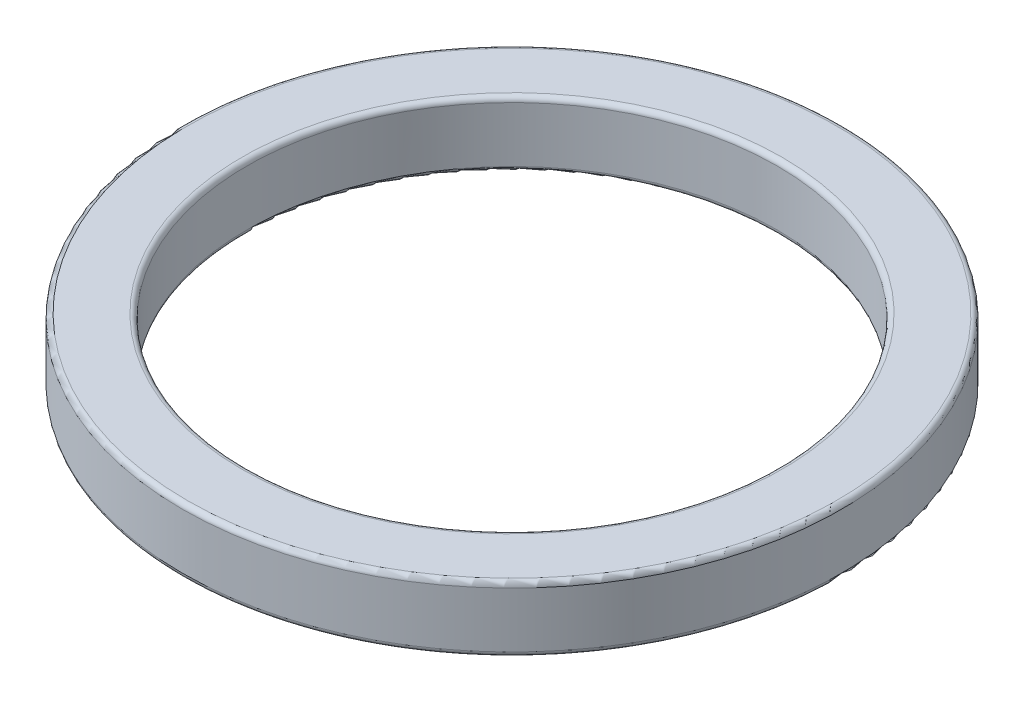
ISO-10303-21;
HEADER;
FILE_DESCRIPTION(('STEP AP214'),'2;1');
FILE_NAME('part.step','',(''),(''),'','','');
FILE_SCHEMA(('AUTOMOTIVE_DESIGN { 1 0 10303 214 1 1 1 1 }'));
ENDSEC;
DATA;
#1=APPLICATION_CONTEXT('core data for automotive mechanical design processes');
#2=APPLICATION_PROTOCOL_DEFINITION('international standard','automotive_design',2000,#1);
#3=PRODUCT_CONTEXT('',#1,'mechanical');
#4=PRODUCT('Part','Part','',(#3));
#5=PRODUCT_RELATED_PRODUCT_CATEGORY('part','',(#4));
#6=PRODUCT_DEFINITION_FORMATION('','',#4);
#7=PRODUCT_DEFINITION_CONTEXT('part definition',#1,'design');
#8=PRODUCT_DEFINITION('design','',#6,#7);
#9=PRODUCT_DEFINITION_SHAPE('','',#8);
#10=(LENGTH_UNIT() NAMED_UNIT(*) SI_UNIT(.MILLI.,.METRE.));
#11=(NAMED_UNIT(*) PLANE_ANGLE_UNIT() SI_UNIT($,.RADIAN.));
#12=(NAMED_UNIT(*) SI_UNIT($,.STERADIAN.) SOLID_ANGLE_UNIT());
#13=UNCERTAINTY_MEASURE_WITH_UNIT(LENGTH_MEASURE(1.E-05),#10,'distance_accuracy_value','');
#14=(GEOMETRIC_REPRESENTATION_CONTEXT(3) GLOBAL_UNCERTAINTY_ASSIGNED_CONTEXT((#13)) GLOBAL_UNIT_ASSIGNED_CONTEXT((#10,
#11,#12)) REPRESENTATION_CONTEXT('',''));
#15=CARTESIAN_POINT('',(0.,0.,0.));
#16=DIRECTION('',(0.,0.,1.));
#17=DIRECTION('',(1.,0.,0.));
#18=AXIS2_PLACEMENT_3D('',#15,#16,#17);
#19=CARTESIAN_POINT('',(0.,0.,0.));
#20=DIRECTION('',(0.,-1.,0.));
#21=DIRECTION('',(0.,0.,-1.));
#22=AXIS2_PLACEMENT_3D('',#19,#20,#21);
#23=CYLINDRICAL_SURFACE('',#22,5.27);
#24=CARTESIAN_POINT('',(0.,1.77172717271727,0.));
#25=DIRECTION('',(0.,-1.,0.));
#26=DIRECTION('',(0.,0.,-1.));
#27=AXIS2_PLACEMENT_3D('',#24,#25,#26);
#28=CIRCLE('',#27,5.27);
#29=CARTESIAN_POINT('',(0.,1.77172717271727,-5.27));
#30=VERTEX_POINT('',#29);
#31=EDGE_CURVE('E59',#30,#30,#28,.T.);
#32=ORIENTED_EDGE('',*,*,#31,.T.);
#33=EDGE_LOOP('',(#32));
#34=FACE_BOUND('',#33,.T.);
#35=CARTESIAN_POINT('',(0.,2.87172717271727,0.));
#36=DIRECTION('',(0.,1.,0.));
#37=DIRECTION('',(0.,0.,1.));
#38=AXIS2_PLACEMENT_3D('',#35,#36,#37);
#39=CIRCLE('',#38,5.27);
#40=CARTESIAN_POINT('',(0.,2.87172717271727,5.27));
#41=VERTEX_POINT('',#40);
#42=EDGE_CURVE('E62',#41,#41,#39,.T.);
#43=ORIENTED_EDGE('',*,*,#42,.T.);
#44=EDGE_LOOP('',(#43));
#45=FACE_BOUND('',#44,.T.);
#46=ADVANCED_FACE('F33',(#34,#45),#23,.F.);
#47=CARTESIAN_POINT('',(5.27,1.67172717271727,0.));
#48=DIRECTION('',(0.,-1.,0.));
#49=DIRECTION('',(0.,0.,-1.));
#50=AXIS2_PLACEMENT_3D('',#47,#48,#49);
#51=PLANE('',#50);
#52=CARTESIAN_POINT('',(0.,1.67172717271727,0.));
#53=DIRECTION('',(0.,-1.,0.));
#54=DIRECTION('',(0.,0.,-1.));
#55=AXIS2_PLACEMENT_3D('',#52,#53,#54);
#56=CIRCLE('',#55,5.37);
#57=CARTESIAN_POINT('',(0.,1.67172717271727,-5.37));
#58=VERTEX_POINT('',#57);
#59=EDGE_CURVE('E53',#58,#58,#56,.F.);
#60=ORIENTED_EDGE('',*,*,#59,.T.);
#61=EDGE_LOOP('',(#60));
#62=FACE_BOUND('',#61,.T.);
#63=CARTESIAN_POINT('',(0.,1.67172717271727,0.));
#64=DIRECTION('',(0.,-1.,0.));
#65=DIRECTION('',(0.,0.,-1.));
#66=AXIS2_PLACEMENT_3D('',#63,#64,#65);
#67=CIRCLE('',#66,6.45);
#68=CARTESIAN_POINT('',(0.,1.67172717271727,-6.45));
#69=VERTEX_POINT('',#68);
#70=EDGE_CURVE('E56',#69,#69,#67,.T.);
#71=ORIENTED_EDGE('',*,*,#70,.T.);
#72=EDGE_LOOP('',(#71));
#73=FACE_BOUND('',#72,.T.);
#74=ADVANCED_FACE('F76',(#62,#73),#51,.T.);
#75=CARTESIAN_POINT('',(0.,0.,0.));
#76=DIRECTION('',(0.,-1.,0.));
#77=DIRECTION('',(0.,0.,-1.));
#78=AXIS2_PLACEMENT_3D('',#75,#76,#77);
#79=CYLINDRICAL_SURFACE('',#78,6.55);
#80=CARTESIAN_POINT('',(0.,1.77172717271727,0.));
#81=DIRECTION('',(0.,-1.,0.));
#82=DIRECTION('',(0.,0.,-1.));
#83=AXIS2_PLACEMENT_3D('',#80,#81,#82);
#84=CIRCLE('',#83,6.55);
#85=CARTESIAN_POINT('',(0.,1.77172717271727,-6.55));
#86=VERTEX_POINT('',#85);
#87=EDGE_CURVE('E44',#86,#86,#84,.F.);
#88=ORIENTED_EDGE('',*,*,#87,.T.);
#89=EDGE_LOOP('',(#88));
#90=FACE_BOUND('',#89,.T.);
#91=CARTESIAN_POINT('',(0.,2.87172717271727,0.));
#92=DIRECTION('',(0.,1.,0.));
#93=DIRECTION('',(0.,0.,1.));
#94=AXIS2_PLACEMENT_3D('',#91,#92,#93);
#95=CIRCLE('',#94,6.55);
#96=CARTESIAN_POINT('',(0.,2.87172717271727,6.55));
#97=VERTEX_POINT('',#96);
#98=EDGE_CURVE('E48',#97,#97,#95,.F.);
#99=ORIENTED_EDGE('',*,*,#98,.T.);
#100=EDGE_LOOP('',(#99));
#101=FACE_BOUND('',#100,.T.);
#102=ADVANCED_FACE('F82',(#90,#101),#79,.T.);
#103=CARTESIAN_POINT('',(5.27,2.97172717271727,0.));
#104=DIRECTION('',(0.,1.,0.));
#105=DIRECTION('',(0.,0.,1.));
#106=AXIS2_PLACEMENT_3D('',#103,#104,#105);
#107=PLANE('',#106);
#108=CARTESIAN_POINT('',(0.,2.97172717271727,0.));
#109=DIRECTION('',(0.,1.,0.));
#110=DIRECTION('',(0.,0.,1.));
#111=AXIS2_PLACEMENT_3D('',#108,#109,#110);
#112=CIRCLE('',#111,6.45);
#113=CARTESIAN_POINT('',(0.,2.97172717271727,6.45));
#114=VERTEX_POINT('',#113);
#115=EDGE_CURVE('E10',#114,#114,#112,.T.);
#116=ORIENTED_EDGE('',*,*,#115,.T.);
#117=EDGE_LOOP('',(#116));
#118=FACE_BOUND('',#117,.T.);
#119=CARTESIAN_POINT('',(0.,2.97172717271727,0.));
#120=DIRECTION('',(0.,1.,0.));
#121=DIRECTION('',(0.,0.,1.));
#122=AXIS2_PLACEMENT_3D('',#119,#120,#121);
#123=CIRCLE('',#122,5.37);
#124=CARTESIAN_POINT('',(0.,2.97172717271727,5.37));
#125=VERTEX_POINT('',#124);
#126=EDGE_CURVE('E40',#125,#125,#123,.F.);
#127=ORIENTED_EDGE('',*,*,#126,.T.);
#128=EDGE_LOOP('',(#127));
#129=FACE_BOUND('',#128,.T.);
#130=ADVANCED_FACE('F90',(#118,#129),#107,.T.);
#131=CARTESIAN_POINT('',(0.,1.77172717271727,0.));
#132=DIRECTION('',(0.,-1.,0.));
#133=DIRECTION('',(0.,0.,-1.));
#134=AXIS2_PLACEMENT_3D('',#131,#132,#133);
#135=TOROIDAL_SURFACE('',#134,5.37,0.1);
#136=ORIENTED_EDGE('',*,*,#59,.F.);
#137=EDGE_LOOP('',(#136));
#138=FACE_BOUND('',#137,.T.);
#139=ORIENTED_EDGE('',*,*,#31,.F.);
#140=EDGE_LOOP('',(#139));
#141=FACE_BOUND('',#140,.T.);
#142=ADVANCED_FACE('F87',(#138,#141),#135,.T.);
#143=CARTESIAN_POINT('',(0.,1.77172717271727,0.));
#144=DIRECTION('',(0.,-1.,0.));
#145=DIRECTION('',(0.,0.,-1.));
#146=AXIS2_PLACEMENT_3D('',#143,#144,#145);
#147=TOROIDAL_SURFACE('',#146,6.45,0.1);
#148=ORIENTED_EDGE('',*,*,#87,.F.);
#149=EDGE_LOOP('',(#148));
#150=FACE_BOUND('',#149,.T.);
#151=ORIENTED_EDGE('',*,*,#70,.F.);
#152=EDGE_LOOP('',(#151));
#153=FACE_BOUND('',#152,.T.);
#154=ADVANCED_FACE('F73',(#150,#153),#147,.T.);
#155=CARTESIAN_POINT('',(0.,2.87172717271727,0.));
#156=DIRECTION('',(0.,1.,0.));
#157=DIRECTION('',(0.,0.,1.));
#158=AXIS2_PLACEMENT_3D('',#155,#156,#157);
#159=TOROIDAL_SURFACE('',#158,6.45,0.1);
#160=ORIENTED_EDGE('',*,*,#115,.F.);
#161=EDGE_LOOP('',(#160));
#162=FACE_BOUND('',#161,.T.);
#163=ORIENTED_EDGE('',*,*,#98,.F.);
#164=EDGE_LOOP('',(#163));
#165=FACE_BOUND('',#164,.T.);
#166=ADVANCED_FACE('F69',(#162,#165),#159,.T.);
#167=CARTESIAN_POINT('',(0.,2.87172717271727,0.));
#168=DIRECTION('',(0.,1.,0.));
#169=DIRECTION('',(0.,0.,1.));
#170=AXIS2_PLACEMENT_3D('',#167,#168,#169);
#171=TOROIDAL_SURFACE('',#170,5.37,0.1);
#172=ORIENTED_EDGE('',*,*,#42,.F.);
#173=EDGE_LOOP('',(#172));
#174=FACE_BOUND('',#173,.T.);
#175=ORIENTED_EDGE('',*,*,#126,.F.);
#176=EDGE_LOOP('',(#175));
#177=FACE_BOUND('',#176,.T.);
#178=ADVANCED_FACE('F35',(#174,#177),#171,.T.);
#179=CLOSED_SHELL('',(#46,#74,#102,#130,#142,#154,#166,#178));
#180=MANIFOLD_SOLID_BREP('B2',#179);
#181=ADVANCED_BREP_SHAPE_REPRESENTATION('',(#18,#180),#14);
#182=SHAPE_DEFINITION_REPRESENTATION(#9,#181);
ENDSEC;
END-ISO-10303-21;
